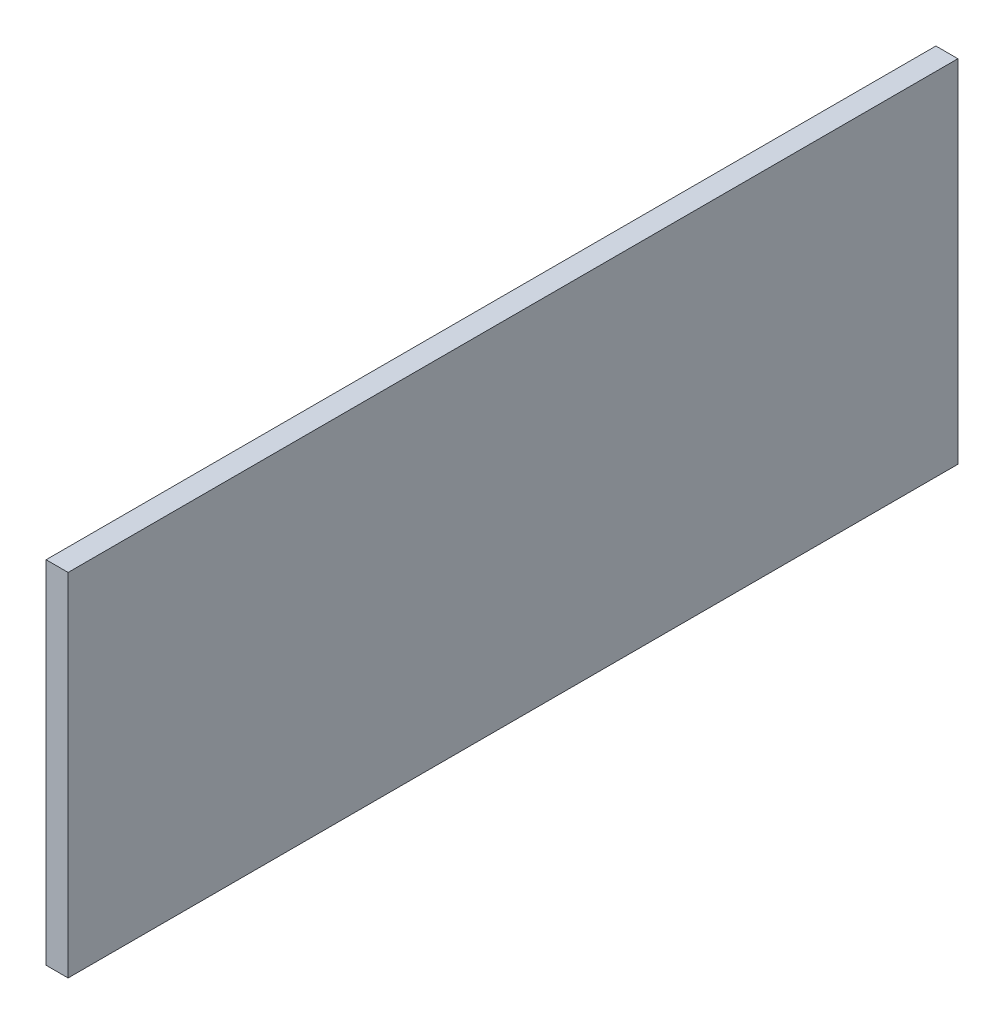
ISO-10303-21;
HEADER;
FILE_DESCRIPTION(('STEP AP214'),'2;1');
FILE_NAME('part.step','',(''),(''),'','','');
FILE_SCHEMA(('AUTOMOTIVE_DESIGN { 1 0 10303 214 1 1 1 1 }'));
ENDSEC;
DATA;
#1=APPLICATION_CONTEXT('core data for automotive mechanical design processes');
#2=APPLICATION_PROTOCOL_DEFINITION('international standard','automotive_design',2000,#1);
#3=PRODUCT_CONTEXT('',#1,'mechanical');
#4=PRODUCT('Part','Part','',(#3));
#5=PRODUCT_RELATED_PRODUCT_CATEGORY('part','',(#4));
#6=PRODUCT_DEFINITION_FORMATION('','',#4);
#7=PRODUCT_DEFINITION_CONTEXT('part definition',#1,'design');
#8=PRODUCT_DEFINITION('design','',#6,#7);
#9=PRODUCT_DEFINITION_SHAPE('','',#8);
#10=(LENGTH_UNIT() NAMED_UNIT(*) SI_UNIT(.MILLI.,.METRE.));
#11=(NAMED_UNIT(*) PLANE_ANGLE_UNIT() SI_UNIT($,.RADIAN.));
#12=(NAMED_UNIT(*) SI_UNIT($,.STERADIAN.) SOLID_ANGLE_UNIT());
#13=UNCERTAINTY_MEASURE_WITH_UNIT(LENGTH_MEASURE(1.E-05),#10,'distance_accuracy_value','');
#14=(GEOMETRIC_REPRESENTATION_CONTEXT(3) GLOBAL_UNCERTAINTY_ASSIGNED_CONTEXT((#13)) GLOBAL_UNIT_ASSIGNED_CONTEXT((#10,
#11,#12)) REPRESENTATION_CONTEXT('',''));
#15=CARTESIAN_POINT('',(0.,0.,0.));
#16=DIRECTION('',(0.,0.,1.));
#17=DIRECTION('',(1.,0.,0.));
#18=AXIS2_PLACEMENT_3D('',#15,#16,#17);
#19=CARTESIAN_POINT('',(11.938,-95.25,-241.3));
#20=DIRECTION('',(0.,0.,1.));
#21=DIRECTION('',(1.,0.,0.));
#22=AXIS2_PLACEMENT_3D('',#19,#20,#21);
#23=PLANE('',#22);
#24=DIRECTION('',(0.,1.,0.));
#25=VECTOR('',#24,1.);
#26=CARTESIAN_POINT('',(0.,-95.25,-241.3));
#27=LINE('',#26,#25);
#28=CARTESIAN_POINT('',(0.,-95.25,-241.3));
#29=VERTEX_POINT('',#28);
#30=CARTESIAN_POINT('',(0.,95.25,-241.3));
#31=VERTEX_POINT('',#30);
#32=EDGE_CURVE('E96',#29,#31,#27,.T.);
#33=ORIENTED_EDGE('',*,*,#32,.T.);
#34=DIRECTION('',(-1.,0.,0.));
#35=VECTOR('',#34,1.);
#36=CARTESIAN_POINT('',(11.938,95.25,-241.3));
#37=LINE('',#36,#35);
#38=CARTESIAN_POINT('',(11.938,95.25,-241.3));
#39=VERTEX_POINT('',#38);
#40=EDGE_CURVE('E11',#39,#31,#37,.T.);
#41=ORIENTED_EDGE('',*,*,#40,.F.);
#42=DIRECTION('',(0.,1.,0.));
#43=VECTOR('',#42,1.);
#44=CARTESIAN_POINT('',(11.938,-95.25,-241.3));
#45=LINE('',#44,#43);
#46=CARTESIAN_POINT('',(11.938,-95.25,-241.3));
#47=VERTEX_POINT('',#46);
#48=EDGE_CURVE('E84',#47,#39,#45,.T.);
#49=ORIENTED_EDGE('',*,*,#48,.F.);
#50=DIRECTION('',(-1.,0.,0.));
#51=VECTOR('',#50,1.);
#52=CARTESIAN_POINT('',(11.938,-95.25,-241.3));
#53=LINE('',#52,#51);
#54=EDGE_CURVE('E92',#47,#29,#53,.T.);
#55=ORIENTED_EDGE('',*,*,#54,.T.);
#56=EDGE_LOOP('',(#33,#41,#49,#55));
#57=FACE_BOUND('',#56,.T.);
#58=ADVANCED_FACE('F33',(#57),#23,.F.);
#59=CARTESIAN_POINT('',(11.938,95.25,241.3));
#60=DIRECTION('',(0.,-1.,0.));
#61=DIRECTION('',(0.,0.,-1.));
#62=AXIS2_PLACEMENT_3D('',#59,#60,#61);
#63=PLANE('',#62);
#64=DIRECTION('',(0.,0.,1.));
#65=VECTOR('',#64,1.);
#66=CARTESIAN_POINT('',(0.,95.25,241.3));
#67=LINE('',#66,#65);
#68=CARTESIAN_POINT('',(0.,95.25,241.3));
#69=VERTEX_POINT('',#68);
#70=EDGE_CURVE('E88',#31,#69,#67,.T.);
#71=ORIENTED_EDGE('',*,*,#70,.T.);
#72=DIRECTION('',(-1.,0.,0.));
#73=VECTOR('',#72,1.);
#74=CARTESIAN_POINT('',(11.938,95.25,241.3));
#75=LINE('',#74,#73);
#76=CARTESIAN_POINT('',(11.938,95.25,241.3));
#77=VERTEX_POINT('',#76);
#78=EDGE_CURVE('E41',#77,#69,#75,.T.);
#79=ORIENTED_EDGE('',*,*,#78,.F.);
#80=DIRECTION('',(0.,0.,1.));
#81=VECTOR('',#80,1.);
#82=CARTESIAN_POINT('',(11.938,95.25,241.3));
#83=LINE('',#82,#81);
#84=EDGE_CURVE('E79',#39,#77,#83,.T.);
#85=ORIENTED_EDGE('',*,*,#84,.F.);
#86=ORIENTED_EDGE('',*,*,#40,.T.);
#87=EDGE_LOOP('',(#71,#79,#85,#86));
#88=FACE_BOUND('',#87,.T.);
#89=ADVANCED_FACE('F87',(#88),#63,.F.);
#90=CARTESIAN_POINT('',(11.938,-95.25,241.3));
#91=DIRECTION('',(0.,0.,-1.));
#92=DIRECTION('',(-1.,0.,0.));
#93=AXIS2_PLACEMENT_3D('',#90,#91,#92);
#94=PLANE('',#93);
#95=DIRECTION('',(0.,-1.,0.));
#96=VECTOR('',#95,1.);
#97=CARTESIAN_POINT('',(0.,-95.25,241.3));
#98=LINE('',#97,#96);
#99=CARTESIAN_POINT('',(0.,-95.25,241.3));
#100=VERTEX_POINT('',#99);
#101=EDGE_CURVE('E66',#69,#100,#98,.T.);
#102=ORIENTED_EDGE('',*,*,#101,.T.);
#103=DIRECTION('',(-1.,0.,0.));
#104=VECTOR('',#103,1.);
#105=CARTESIAN_POINT('',(11.938,-95.25,241.3));
#106=LINE('',#105,#104);
#107=CARTESIAN_POINT('',(11.938,-95.25,241.3));
#108=VERTEX_POINT('',#107);
#109=EDGE_CURVE('E89',#108,#100,#106,.T.);
#110=ORIENTED_EDGE('',*,*,#109,.F.);
#111=DIRECTION('',(0.,-1.,0.));
#112=VECTOR('',#111,1.);
#113=CARTESIAN_POINT('',(11.938,-95.25,241.3));
#114=LINE('',#113,#112);
#115=EDGE_CURVE('E82',#77,#108,#114,.T.);
#116=ORIENTED_EDGE('',*,*,#115,.F.);
#117=ORIENTED_EDGE('',*,*,#78,.T.);
#118=EDGE_LOOP('',(#102,#110,#116,#117));
#119=FACE_BOUND('',#118,.T.);
#120=ADVANCED_FACE('F90',(#119),#94,.F.);
#121=CARTESIAN_POINT('',(11.938,-95.25,241.3));
#122=DIRECTION('',(0.,1.,0.));
#123=DIRECTION('',(0.,0.,1.));
#124=AXIS2_PLACEMENT_3D('',#121,#122,#123);
#125=PLANE('',#124);
#126=DIRECTION('',(0.,0.,-1.));
#127=VECTOR('',#126,1.);
#128=CARTESIAN_POINT('',(0.,-95.25,241.3));
#129=LINE('',#128,#127);
#130=EDGE_CURVE('E72',#100,#29,#129,.T.);
#131=ORIENTED_EDGE('',*,*,#130,.T.);
#132=ORIENTED_EDGE('',*,*,#54,.F.);
#133=DIRECTION('',(0.,0.,-1.));
#134=VECTOR('',#133,1.);
#135=CARTESIAN_POINT('',(11.938,-95.25,241.3));
#136=LINE('',#135,#134);
#137=EDGE_CURVE('E49',#108,#47,#136,.T.);
#138=ORIENTED_EDGE('',*,*,#137,.F.);
#139=ORIENTED_EDGE('',*,*,#109,.T.);
#140=EDGE_LOOP('',(#131,#132,#138,#139));
#141=FACE_BOUND('',#140,.T.);
#142=ADVANCED_FACE('F103',(#141),#125,.F.);
#143=CARTESIAN_POINT('',(11.938,0.,0.));
#144=DIRECTION('',(-1.,0.,0.));
#145=DIRECTION('',(0.,0.,1.));
#146=AXIS2_PLACEMENT_3D('',#143,#144,#145);
#147=PLANE('',#146);
#148=ORIENTED_EDGE('',*,*,#48,.T.);
#149=ORIENTED_EDGE('',*,*,#84,.T.);
#150=ORIENTED_EDGE('',*,*,#115,.T.);
#151=ORIENTED_EDGE('',*,*,#137,.T.);
#152=EDGE_LOOP('',(#148,#149,#150,#151));
#153=FACE_BOUND('',#152,.T.);
#154=ADVANCED_FACE('F80',(#153),#147,.F.);
#155=CARTESIAN_POINT('',(0.,0.,0.));
#156=DIRECTION('',(-1.,0.,0.));
#157=DIRECTION('',(0.,0.,1.));
#158=AXIS2_PLACEMENT_3D('',#155,#156,#157);
#159=PLANE('',#158);
#160=ORIENTED_EDGE('',*,*,#32,.F.);
#161=ORIENTED_EDGE('',*,*,#130,.F.);
#162=ORIENTED_EDGE('',*,*,#101,.F.);
#163=ORIENTED_EDGE('',*,*,#70,.F.);
#164=EDGE_LOOP('',(#160,#161,#162,#163));
#165=FACE_BOUND('',#164,.T.);
#166=ADVANCED_FACE('F106',(#165),#159,.T.);
#167=CLOSED_SHELL('',(#58,#89,#120,#142,#154,#166));
#168=MANIFOLD_SOLID_BREP('B2',#167);
#169=ADVANCED_BREP_SHAPE_REPRESENTATION('',(#18,#168),#14);
#170=SHAPE_DEFINITION_REPRESENTATION(#9,#169);
ENDSEC;
END-ISO-10303-21;
